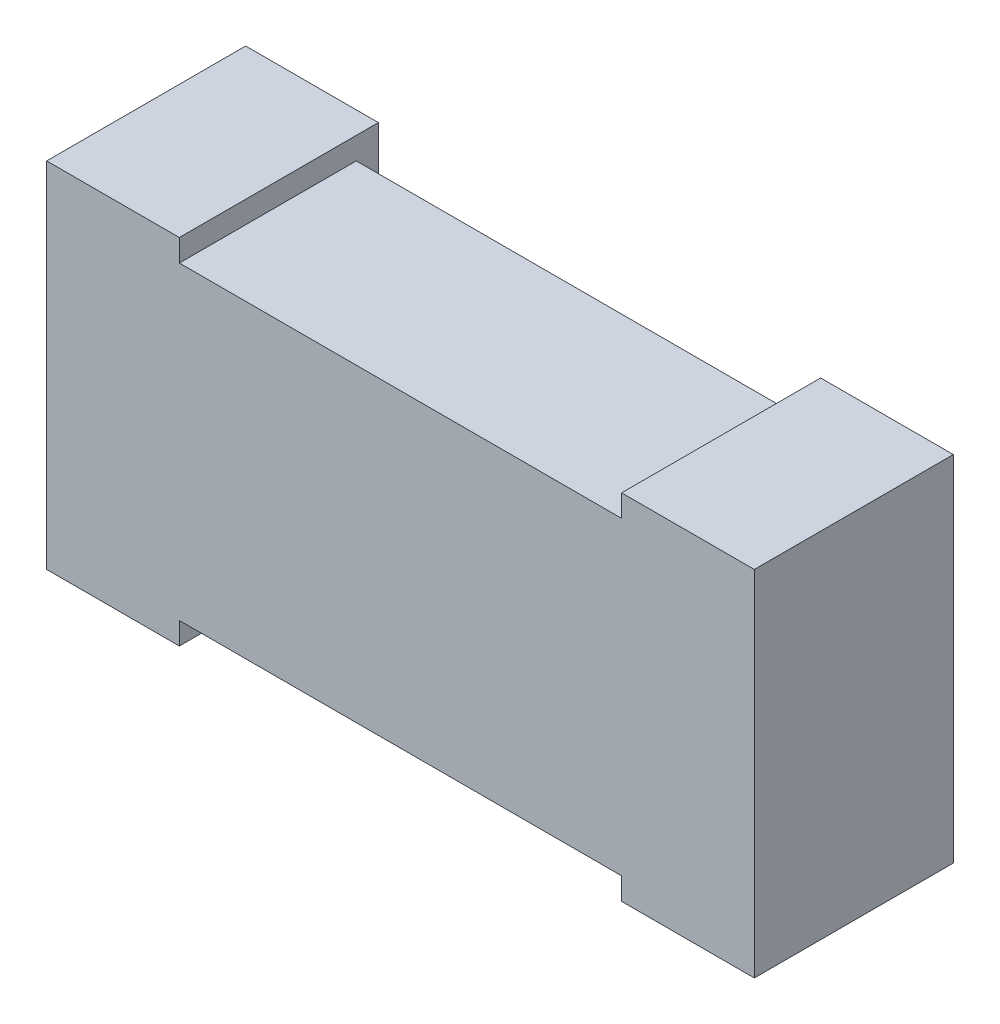
ISO-10303-21;
HEADER;
FILE_DESCRIPTION(('STEP AP214'),'2;1');
FILE_NAME('part.step','',(''),(''),'','','');
FILE_SCHEMA(('AUTOMOTIVE_DESIGN { 1 0 10303 214 1 1 1 1 }'));
ENDSEC;
DATA;
#1=APPLICATION_CONTEXT('core data for automotive mechanical design processes');
#2=APPLICATION_PROTOCOL_DEFINITION('international standard','automotive_design',2000,#1);
#3=PRODUCT_CONTEXT('',#1,'mechanical');
#4=PRODUCT('Part','Part','',(#3));
#5=PRODUCT_RELATED_PRODUCT_CATEGORY('part','',(#4));
#6=PRODUCT_DEFINITION_FORMATION('','',#4);
#7=PRODUCT_DEFINITION_CONTEXT('part definition',#1,'design');
#8=PRODUCT_DEFINITION('design','',#6,#7);
#9=PRODUCT_DEFINITION_SHAPE('','',#8);
#10=(LENGTH_UNIT() NAMED_UNIT(*) SI_UNIT(.MILLI.,.METRE.));
#11=(NAMED_UNIT(*) PLANE_ANGLE_UNIT() SI_UNIT($,.RADIAN.));
#12=(NAMED_UNIT(*) SI_UNIT($,.STERADIAN.) SOLID_ANGLE_UNIT());
#13=UNCERTAINTY_MEASURE_WITH_UNIT(LENGTH_MEASURE(1.E-05),#10,'distance_accuracy_value','');
#14=(GEOMETRIC_REPRESENTATION_CONTEXT(3) GLOBAL_UNCERTAINTY_ASSIGNED_CONTEXT((#13)) GLOBAL_UNIT_ASSIGNED_CONTEXT((#10,
#11,#12)) REPRESENTATION_CONTEXT('',''));
#15=CARTESIAN_POINT('',(0.,0.,0.));
#16=DIRECTION('',(0.,0.,1.));
#17=DIRECTION('',(1.,0.,0.));
#18=AXIS2_PLACEMENT_3D('',#15,#16,#17);
#19=CARTESIAN_POINT('',(2.399,0.399,-7.45));
#20=DIRECTION('',(0.,0.,-1.));
#21=DIRECTION('',(0.,1.,0.));
#22=AXIS2_PLACEMENT_3D('',#19,#20,#21);
#23=PLANE('',#22);
#24=DIRECTION('',(1.,0.,0.));
#25=VECTOR('',#24,1.);
#26=CARTESIAN_POINT('',(2.55,0.4,-7.45));
#27=LINE('',#26,#25);
#28=CARTESIAN_POINT('',(2.4,0.4,-7.45));
#29=VERTEX_POINT('',#28);
#30=CARTESIAN_POINT('',(2.7,0.4,-7.45));
#31=VERTEX_POINT('',#30);
#32=EDGE_CURVE('E110',#29,#31,#27,.T.);
#33=ORIENTED_EDGE('',*,*,#32,.F.);
#34=DIRECTION('',(0.,-1.,0.));
#35=VECTOR('',#34,1.);
#36=CARTESIAN_POINT('',(2.4,0.8,-7.45));
#37=LINE('',#36,#35);
#38=CARTESIAN_POINT('',(2.4,1.2,-7.45));
#39=VERTEX_POINT('',#38);
#40=EDGE_CURVE('E104',#39,#29,#37,.T.);
#41=ORIENTED_EDGE('',*,*,#40,.F.);
#42=DIRECTION('',(-1.,0.,0.));
#43=VECTOR('',#42,1.);
#44=CARTESIAN_POINT('',(2.55,1.2,-7.45));
#45=LINE('',#44,#43);
#46=CARTESIAN_POINT('',(2.7,1.2,-7.45));
#47=VERTEX_POINT('',#46);
#48=EDGE_CURVE('E21',#47,#39,#45,.T.);
#49=ORIENTED_EDGE('',*,*,#48,.F.);
#50=DIRECTION('',(0.,1.,0.));
#51=VECTOR('',#50,1.);
#52=CARTESIAN_POINT('',(2.7,0.8,-7.45));
#53=LINE('',#52,#51);
#54=EDGE_CURVE('E131',#31,#47,#53,.T.);
#55=ORIENTED_EDGE('',*,*,#54,.F.);
#56=EDGE_LOOP('',(#33,#41,#49,#55));
#57=FACE_BOUND('',#56,.T.);
#58=ADVANCED_FACE('F17',(#57),#23,.T.);
#59=CARTESIAN_POINT('',(2.399,1.2,-6.999));
#60=DIRECTION('',(0.,1.,0.));
#61=DIRECTION('',(1.,0.,0.));
#62=AXIS2_PLACEMENT_3D('',#59,#60,#61);
#63=PLANE('',#62);
#64=DIRECTION('',(0.,0.,1.));
#65=VECTOR('',#64,1.);
#66=CARTESIAN_POINT('',(2.7,1.2,-7.225));
#67=LINE('',#66,#65);
#68=CARTESIAN_POINT('',(2.7,1.2,-7.));
#69=VERTEX_POINT('',#68);
#70=EDGE_CURVE('E117',#47,#69,#67,.T.);
#71=ORIENTED_EDGE('',*,*,#70,.F.);
#72=ORIENTED_EDGE('',*,*,#48,.T.);
#73=DIRECTION('',(0.,0.,-1.));
#74=VECTOR('',#73,1.);
#75=CARTESIAN_POINT('',(2.4,1.2,-7.225));
#76=LINE('',#75,#74);
#77=CARTESIAN_POINT('',(2.4,1.2,-7.));
#78=VERTEX_POINT('',#77);
#79=EDGE_CURVE('E112',#78,#39,#76,.T.);
#80=ORIENTED_EDGE('',*,*,#79,.F.);
#81=DIRECTION('',(-1.,0.,0.));
#82=VECTOR('',#81,1.);
#83=CARTESIAN_POINT('',(3.2,1.2,-7.));
#84=LINE('',#83,#82);
#85=EDGE_CURVE('E155',#69,#78,#84,.T.);
#86=ORIENTED_EDGE('',*,*,#85,.F.);
#87=EDGE_LOOP('',(#71,#72,#80,#86));
#88=FACE_BOUND('',#87,.T.);
#89=ADVANCED_FACE('F114',(#88),#63,.T.);
#90=CARTESIAN_POINT('',(2.4,0.399,-6.999));
#91=DIRECTION('',(-1.,0.,0.));
#92=DIRECTION('',(0.,1.,0.));
#93=AXIS2_PLACEMENT_3D('',#90,#91,#92);
#94=PLANE('',#93);
#95=DIRECTION('',(0.,-1.,0.));
#96=VECTOR('',#95,1.);
#97=CARTESIAN_POINT('',(2.4,0.8,-7.));
#98=LINE('',#97,#96);
#99=CARTESIAN_POINT('',(2.4,0.4,-7.));
#100=VERTEX_POINT('',#99);
#101=EDGE_CURVE('E121',#78,#100,#98,.T.);
#102=ORIENTED_EDGE('',*,*,#101,.F.);
#103=ORIENTED_EDGE('',*,*,#79,.T.);
#104=ORIENTED_EDGE('',*,*,#40,.T.);
#105=DIRECTION('',(0.,0.,-1.));
#106=VECTOR('',#105,1.);
#107=CARTESIAN_POINT('',(2.4,0.4,-7.225));
#108=LINE('',#107,#106);
#109=EDGE_CURVE('E123',#100,#29,#108,.T.);
#110=ORIENTED_EDGE('',*,*,#109,.F.);
#111=EDGE_LOOP('',(#102,#103,#104,#110));
#112=FACE_BOUND('',#111,.T.);
#113=ADVANCED_FACE('F119',(#112),#94,.T.);
#114=CARTESIAN_POINT('',(2.701,0.4,-6.999));
#115=DIRECTION('',(0.,-1.,0.));
#116=DIRECTION('',(-1.,0.,0.));
#117=AXIS2_PLACEMENT_3D('',#114,#115,#116);
#118=PLANE('',#117);
#119=ORIENTED_EDGE('',*,*,#109,.T.);
#120=ORIENTED_EDGE('',*,*,#32,.T.);
#121=DIRECTION('',(0.,0.,-1.));
#122=VECTOR('',#121,1.);
#123=CARTESIAN_POINT('',(2.7,0.4,-7.225));
#124=LINE('',#123,#122);
#125=CARTESIAN_POINT('',(2.7,0.4,-7.));
#126=VERTEX_POINT('',#125);
#127=EDGE_CURVE('E128',#126,#31,#124,.T.);
#128=ORIENTED_EDGE('',*,*,#127,.F.);
#129=DIRECTION('',(1.,0.,0.));
#130=VECTOR('',#129,1.);
#131=CARTESIAN_POINT('',(3.2,0.4,-7.));
#132=LINE('',#131,#130);
#133=EDGE_CURVE('E158',#100,#126,#132,.T.);
#134=ORIENTED_EDGE('',*,*,#133,.F.);
#135=EDGE_LOOP('',(#119,#120,#128,#134));
#136=FACE_BOUND('',#135,.T.);
#137=ADVANCED_FACE('F228',(#136),#118,.T.);
#138=CARTESIAN_POINT('',(2.7,1.201,-6.999));
#139=DIRECTION('',(1.,0.,0.));
#140=DIRECTION('',(0.,-1.,0.));
#141=AXIS2_PLACEMENT_3D('',#138,#139,#140);
#142=PLANE('',#141);
#143=ORIENTED_EDGE('',*,*,#70,.T.);
#144=DIRECTION('',(0.,1.,0.));
#145=VECTOR('',#144,1.);
#146=CARTESIAN_POINT('',(2.7,0.8,-7.));
#147=LINE('',#146,#145);
#148=CARTESIAN_POINT('',(2.7,1.15,-7.));
#149=VERTEX_POINT('',#148);
#150=EDGE_CURVE('E152',#149,#69,#147,.T.);
#151=ORIENTED_EDGE('',*,*,#150,.F.);
#152=DIRECTION('',(0.,0.,1.));
#153=VECTOR('',#152,1.);
#154=CARTESIAN_POINT('',(2.7,1.15,-7.2));
#155=LINE('',#154,#153);
#156=CARTESIAN_POINT('',(2.7,1.15,-7.4));
#157=VERTEX_POINT('',#156);
#158=EDGE_CURVE('E142',#157,#149,#155,.T.);
#159=ORIENTED_EDGE('',*,*,#158,.F.);
#160=DIRECTION('',(0.,1.,0.));
#161=VECTOR('',#160,1.);
#162=CARTESIAN_POINT('',(2.7,0.8,-7.4));
#163=LINE('',#162,#161);
#164=CARTESIAN_POINT('',(2.7,0.45,-7.4));
#165=VERTEX_POINT('',#164);
#166=EDGE_CURVE('E139',#165,#157,#163,.T.);
#167=ORIENTED_EDGE('',*,*,#166,.F.);
#168=DIRECTION('',(0.,0.,-1.));
#169=VECTOR('',#168,1.);
#170=CARTESIAN_POINT('',(2.7,0.45,-7.2));
#171=LINE('',#170,#169);
#172=CARTESIAN_POINT('',(2.7,0.45,-7.));
#173=VERTEX_POINT('',#172);
#174=EDGE_CURVE('E134',#173,#165,#171,.T.);
#175=ORIENTED_EDGE('',*,*,#174,.F.);
#176=DIRECTION('',(0.,1.,0.));
#177=VECTOR('',#176,1.);
#178=CARTESIAN_POINT('',(2.7,0.8,-7.));
#179=LINE('',#178,#177);
#180=EDGE_CURVE('E161',#126,#173,#179,.T.);
#181=ORIENTED_EDGE('',*,*,#180,.F.);
#182=ORIENTED_EDGE('',*,*,#127,.T.);
#183=ORIENTED_EDGE('',*,*,#54,.T.);
#184=EDGE_LOOP('',(#143,#151,#159,#167,#175,#181,#182,#183));
#185=FACE_BOUND('',#184,.T.);
#186=ADVANCED_FACE('F224',(#185),#142,.T.);
#187=CARTESIAN_POINT('',(3.701,0.45,-6.999));
#188=DIRECTION('',(0.,-1.,0.));
#189=DIRECTION('',(-1.,0.,0.));
#190=AXIS2_PLACEMENT_3D('',#187,#188,#189);
#191=PLANE('',#190);
#192=ORIENTED_EDGE('',*,*,#174,.T.);
#193=DIRECTION('',(-1.,0.,0.));
#194=VECTOR('',#193,1.);
#195=CARTESIAN_POINT('',(3.2,0.45,-7.4));
#196=LINE('',#195,#194);
#197=CARTESIAN_POINT('',(3.7,0.45,-7.4));
#198=VERTEX_POINT('',#197);
#199=EDGE_CURVE('E136',#198,#165,#196,.T.);
#200=ORIENTED_EDGE('',*,*,#199,.F.);
#201=DIRECTION('',(0.,0.,-1.));
#202=VECTOR('',#201,1.);
#203=CARTESIAN_POINT('',(3.7,0.45,-7.225));
#204=LINE('',#203,#202);
#205=CARTESIAN_POINT('',(3.7,0.45,-7.));
#206=VERTEX_POINT('',#205);
#207=EDGE_CURVE('E169',#206,#198,#204,.T.);
#208=ORIENTED_EDGE('',*,*,#207,.F.);
#209=DIRECTION('',(1.,0.,0.));
#210=VECTOR('',#209,1.);
#211=CARTESIAN_POINT('',(3.2,0.45,-7.));
#212=LINE('',#211,#210);
#213=EDGE_CURVE('E147',#173,#206,#212,.T.);
#214=ORIENTED_EDGE('',*,*,#213,.F.);
#215=EDGE_LOOP('',(#192,#200,#208,#214));
#216=FACE_BOUND('',#215,.T.);
#217=ADVANCED_FACE('F232',(#216),#191,.T.);
#218=CARTESIAN_POINT('',(2.699,0.449,-7.4));
#219=DIRECTION('',(0.,0.,-1.));
#220=DIRECTION('',(0.,1.,0.));
#221=AXIS2_PLACEMENT_3D('',#218,#219,#220);
#222=PLANE('',#221);
#223=ORIENTED_EDGE('',*,*,#199,.T.);
#224=ORIENTED_EDGE('',*,*,#166,.T.);
#225=DIRECTION('',(-1.,0.,0.));
#226=VECTOR('',#225,1.);
#227=CARTESIAN_POINT('',(3.2,1.15,-7.4));
#228=LINE('',#227,#226);
#229=CARTESIAN_POINT('',(3.7,1.15,-7.4));
#230=VERTEX_POINT('',#229);
#231=EDGE_CURVE('E144',#230,#157,#228,.T.);
#232=ORIENTED_EDGE('',*,*,#231,.F.);
#233=DIRECTION('',(0.,1.,0.));
#234=VECTOR('',#233,1.);
#235=CARTESIAN_POINT('',(3.7,0.8,-7.4));
#236=LINE('',#235,#234);
#237=EDGE_CURVE('E172',#198,#230,#236,.T.);
#238=ORIENTED_EDGE('',*,*,#237,.F.);
#239=EDGE_LOOP('',(#223,#224,#232,#238));
#240=FACE_BOUND('',#239,.T.);
#241=ADVANCED_FACE('F235',(#240),#222,.T.);
#242=CARTESIAN_POINT('',(2.699,1.15,-6.999));
#243=DIRECTION('',(0.,1.,0.));
#244=DIRECTION('',(1.,0.,0.));
#245=AXIS2_PLACEMENT_3D('',#242,#243,#244);
#246=PLANE('',#245);
#247=DIRECTION('',(0.,0.,1.));
#248=VECTOR('',#247,1.);
#249=CARTESIAN_POINT('',(3.7,1.15,-7.225));
#250=LINE('',#249,#248);
#251=CARTESIAN_POINT('',(3.7,1.15,-7.));
#252=VERTEX_POINT('',#251);
#253=EDGE_CURVE('E175',#230,#252,#250,.T.);
#254=ORIENTED_EDGE('',*,*,#253,.F.);
#255=ORIENTED_EDGE('',*,*,#231,.T.);
#256=ORIENTED_EDGE('',*,*,#158,.T.);
#257=DIRECTION('',(-1.,0.,0.));
#258=VECTOR('',#257,1.);
#259=CARTESIAN_POINT('',(3.2,1.15,-7.));
#260=LINE('',#259,#258);
#261=EDGE_CURVE('E149',#252,#149,#260,.T.);
#262=ORIENTED_EDGE('',*,*,#261,.F.);
#263=EDGE_LOOP('',(#254,#255,#256,#262));
#264=FACE_BOUND('',#263,.T.);
#265=ADVANCED_FACE('F221',(#264),#246,.T.);
#266=CARTESIAN_POINT('',(2.399,1.201,-7.));
#267=DIRECTION('',(0.,0.,1.));
#268=DIRECTION('',(0.,-1.,0.));
#269=AXIS2_PLACEMENT_3D('',#266,#267,#268);
#270=PLANE('',#269);
#271=ORIENTED_EDGE('',*,*,#133,.T.);
#272=ORIENTED_EDGE('',*,*,#180,.T.);
#273=ORIENTED_EDGE('',*,*,#213,.T.);
#274=DIRECTION('',(0.,1.,0.));
#275=VECTOR('',#274,1.);
#276=CARTESIAN_POINT('',(3.7,0.8,-7.));
#277=LINE('',#276,#275);
#278=CARTESIAN_POINT('',(3.7,0.4,-7.));
#279=VERTEX_POINT('',#278);
#280=EDGE_CURVE('E166',#279,#206,#277,.T.);
#281=ORIENTED_EDGE('',*,*,#280,.F.);
#282=DIRECTION('',(-1.,0.,0.));
#283=VECTOR('',#282,1.);
#284=CARTESIAN_POINT('',(3.85,0.4,-7.));
#285=LINE('',#284,#283);
#286=CARTESIAN_POINT('',(4.,0.4,-7.));
#287=VERTEX_POINT('',#286);
#288=EDGE_CURVE('E192',#287,#279,#285,.T.);
#289=ORIENTED_EDGE('',*,*,#288,.F.);
#290=DIRECTION('',(0.,-1.,0.));
#291=VECTOR('',#290,1.);
#292=CARTESIAN_POINT('',(4.,0.8,-7.));
#293=LINE('',#292,#291);
#294=CARTESIAN_POINT('',(4.,1.2,-7.));
#295=VERTEX_POINT('',#294);
#296=EDGE_CURVE('E186',#295,#287,#293,.T.);
#297=ORIENTED_EDGE('',*,*,#296,.F.);
#298=DIRECTION('',(1.,0.,0.));
#299=VECTOR('',#298,1.);
#300=CARTESIAN_POINT('',(3.85,1.2,-7.));
#301=LINE('',#300,#299);
#302=CARTESIAN_POINT('',(3.7,1.2,-7.));
#303=VERTEX_POINT('',#302);
#304=EDGE_CURVE('E181',#303,#295,#301,.T.);
#305=ORIENTED_EDGE('',*,*,#304,.F.);
#306=DIRECTION('',(0.,1.,0.));
#307=VECTOR('',#306,1.);
#308=CARTESIAN_POINT('',(3.7,0.8,-7.));
#309=LINE('',#308,#307);
#310=EDGE_CURVE('E164',#252,#303,#309,.T.);
#311=ORIENTED_EDGE('',*,*,#310,.F.);
#312=ORIENTED_EDGE('',*,*,#261,.T.);
#313=ORIENTED_EDGE('',*,*,#150,.T.);
#314=ORIENTED_EDGE('',*,*,#85,.T.);
#315=ORIENTED_EDGE('',*,*,#101,.T.);
#316=EDGE_LOOP('',(#271,#272,#273,#281,#289,#297,#305,#311,#312,#313,#314,#315));
#317=FACE_BOUND('',#316,.T.);
#318=ADVANCED_FACE('F212',(#317),#270,.T.);
#319=CARTESIAN_POINT('',(3.7,0.399,-6.999));
#320=DIRECTION('',(-1.,0.,0.));
#321=DIRECTION('',(0.,1.,0.));
#322=AXIS2_PLACEMENT_3D('',#319,#320,#321);
#323=PLANE('',#322);
#324=ORIENTED_EDGE('',*,*,#237,.T.);
#325=ORIENTED_EDGE('',*,*,#253,.T.);
#326=ORIENTED_EDGE('',*,*,#310,.T.);
#327=DIRECTION('',(0.,0.,1.));
#328=VECTOR('',#327,1.);
#329=CARTESIAN_POINT('',(3.7,1.2,-7.225));
#330=LINE('',#329,#328);
#331=CARTESIAN_POINT('',(3.7,1.2,-7.45));
#332=VERTEX_POINT('',#331);
#333=EDGE_CURVE('E178',#332,#303,#330,.T.);
#334=ORIENTED_EDGE('',*,*,#333,.F.);
#335=DIRECTION('',(0.,1.,0.));
#336=VECTOR('',#335,1.);
#337=CARTESIAN_POINT('',(3.7,0.8,-7.45));
#338=LINE('',#337,#336);
#339=CARTESIAN_POINT('',(3.7,0.4,-7.45));
#340=VERTEX_POINT('',#339);
#341=EDGE_CURVE('E195',#340,#332,#338,.T.);
#342=ORIENTED_EDGE('',*,*,#341,.F.);
#343=DIRECTION('',(0.,0.,-1.));
#344=VECTOR('',#343,1.);
#345=CARTESIAN_POINT('',(3.7,0.4,-7.225));
#346=LINE('',#345,#344);
#347=EDGE_CURVE('E188',#279,#340,#346,.T.);
#348=ORIENTED_EDGE('',*,*,#347,.F.);
#349=ORIENTED_EDGE('',*,*,#280,.T.);
#350=ORIENTED_EDGE('',*,*,#207,.T.);
#351=EDGE_LOOP('',(#324,#325,#326,#334,#342,#348,#349,#350));
#352=FACE_BOUND('',#351,.T.);
#353=ADVANCED_FACE('F217',(#352),#323,.T.);
#354=CARTESIAN_POINT('',(3.699,1.2,-6.999));
#355=DIRECTION('',(0.,1.,0.));
#356=DIRECTION('',(1.,0.,0.));
#357=AXIS2_PLACEMENT_3D('',#354,#355,#356);
#358=PLANE('',#357);
#359=DIRECTION('',(0.,0.,1.));
#360=VECTOR('',#359,1.);
#361=CARTESIAN_POINT('',(4.,1.2,-7.225));
#362=LINE('',#361,#360);
#363=CARTESIAN_POINT('',(4.,1.2,-7.45));
#364=VERTEX_POINT('',#363);
#365=EDGE_CURVE('E183',#364,#295,#362,.T.);
#366=ORIENTED_EDGE('',*,*,#365,.F.);
#367=DIRECTION('',(1.,0.,0.));
#368=VECTOR('',#367,1.);
#369=CARTESIAN_POINT('',(3.85,1.2,-7.45));
#370=LINE('',#369,#368);
#371=EDGE_CURVE('E198',#332,#364,#370,.T.);
#372=ORIENTED_EDGE('',*,*,#371,.F.);
#373=ORIENTED_EDGE('',*,*,#333,.T.);
#374=ORIENTED_EDGE('',*,*,#304,.T.);
#375=EDGE_LOOP('',(#366,#372,#373,#374));
#376=FACE_BOUND('',#375,.T.);
#377=ADVANCED_FACE('F208',(#376),#358,.T.);
#378=CARTESIAN_POINT('',(4.,1.201,-6.999));
#379=DIRECTION('',(1.,0.,0.));
#380=DIRECTION('',(0.,-1.,0.));
#381=AXIS2_PLACEMENT_3D('',#378,#379,#380);
#382=PLANE('',#381);
#383=DIRECTION('',(0.,0.,1.));
#384=VECTOR('',#383,1.);
#385=CARTESIAN_POINT('',(4.,0.4,-7.225));
#386=LINE('',#385,#384);
#387=CARTESIAN_POINT('',(4.,0.4,-7.45));
#388=VERTEX_POINT('',#387);
#389=EDGE_CURVE('E36',#388,#287,#386,.T.);
#390=ORIENTED_EDGE('',*,*,#389,.F.);
#391=DIRECTION('',(0.,-1.,0.));
#392=VECTOR('',#391,1.);
#393=CARTESIAN_POINT('',(4.,0.8,-7.45));
#394=LINE('',#393,#392);
#395=EDGE_CURVE('E27',#364,#388,#394,.T.);
#396=ORIENTED_EDGE('',*,*,#395,.F.);
#397=ORIENTED_EDGE('',*,*,#365,.T.);
#398=ORIENTED_EDGE('',*,*,#296,.T.);
#399=EDGE_LOOP('',(#390,#396,#397,#398));
#400=FACE_BOUND('',#399,.T.);
#401=ADVANCED_FACE('F204',(#400),#382,.T.);
#402=CARTESIAN_POINT('',(4.001,0.4,-6.999));
#403=DIRECTION('',(0.,-1.,0.));
#404=DIRECTION('',(-1.,0.,0.));
#405=AXIS2_PLACEMENT_3D('',#402,#403,#404);
#406=PLANE('',#405);
#407=ORIENTED_EDGE('',*,*,#389,.T.);
#408=ORIENTED_EDGE('',*,*,#288,.T.);
#409=ORIENTED_EDGE('',*,*,#347,.T.);
#410=DIRECTION('',(-1.,0.,0.));
#411=VECTOR('',#410,1.);
#412=CARTESIAN_POINT('',(3.85,0.4,-7.45));
#413=LINE('',#412,#411);
#414=EDGE_CURVE('E11',#388,#340,#413,.T.);
#415=ORIENTED_EDGE('',*,*,#414,.F.);
#416=EDGE_LOOP('',(#407,#408,#409,#415));
#417=FACE_BOUND('',#416,.T.);
#418=ADVANCED_FACE('F215',(#417),#406,.T.);
#419=CARTESIAN_POINT('',(3.699,0.399,-7.45));
#420=DIRECTION('',(0.,0.,-1.));
#421=DIRECTION('',(0.,1.,0.));
#422=AXIS2_PLACEMENT_3D('',#419,#420,#421);
#423=PLANE('',#422);
#424=ORIENTED_EDGE('',*,*,#395,.T.);
#425=ORIENTED_EDGE('',*,*,#414,.T.);
#426=ORIENTED_EDGE('',*,*,#341,.T.);
#427=ORIENTED_EDGE('',*,*,#371,.T.);
#428=EDGE_LOOP('',(#424,#425,#426,#427));
#429=FACE_BOUND('',#428,.T.);
#430=ADVANCED_FACE('F19',(#429),#423,.T.);
#431=CLOSED_SHELL('',(#58,#89,#113,#137,#186,#217,#241,#265,#318,#353,#377,#401,#418,#430));
#432=MANIFOLD_SOLID_BREP('B1',#431);
#433=ADVANCED_BREP_SHAPE_REPRESENTATION('',(#18,#432),#14);
#434=SHAPE_DEFINITION_REPRESENTATION(#9,#433);
ENDSEC;
END-ISO-10303-21;
